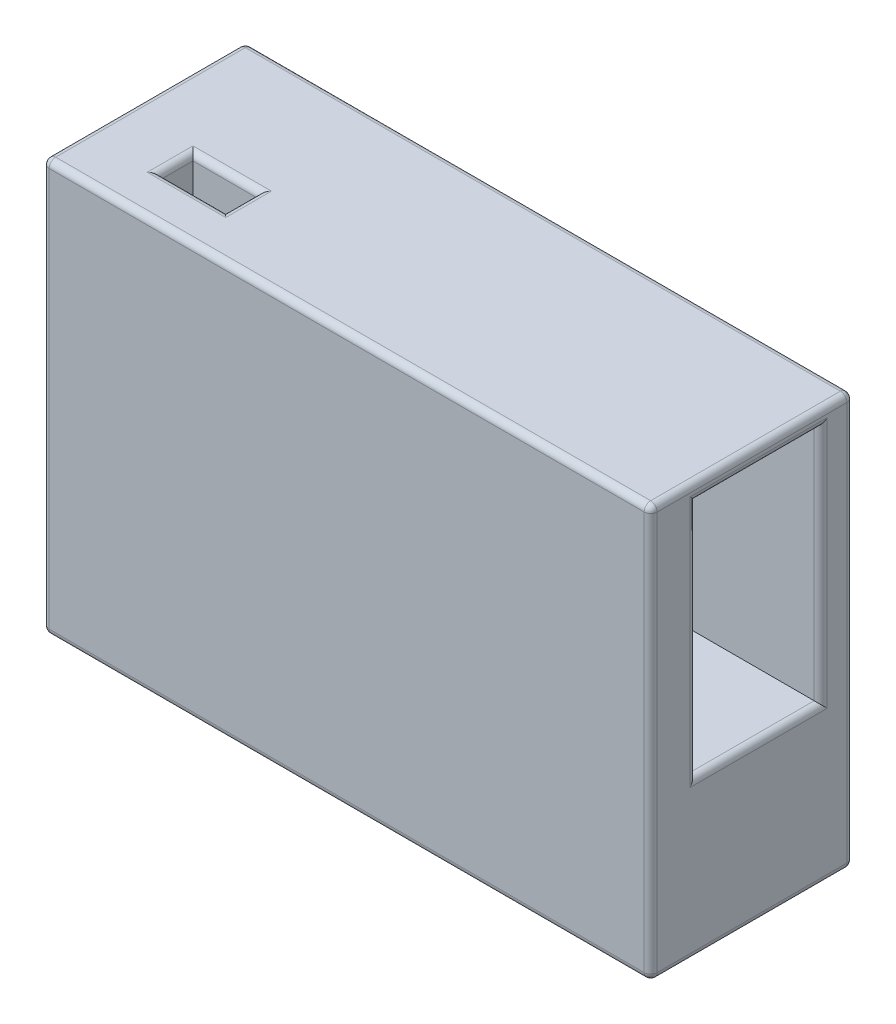
ISO-10303-21;
HEADER;
FILE_DESCRIPTION(('STEP AP214'),'2;1');
FILE_NAME('part.step','',(''),(''),'','','');
FILE_SCHEMA(('AUTOMOTIVE_DESIGN { 1 0 10303 214 1 1 1 1 }'));
ENDSEC;
DATA;
#1=APPLICATION_CONTEXT('core data for automotive mechanical design processes');
#2=APPLICATION_PROTOCOL_DEFINITION('international standard','automotive_design',2000,#1);
#3=PRODUCT_CONTEXT('',#1,'mechanical');
#4=PRODUCT('Part','Part','',(#3));
#5=PRODUCT_RELATED_PRODUCT_CATEGORY('part','',(#4));
#6=PRODUCT_DEFINITION_FORMATION('','',#4);
#7=PRODUCT_DEFINITION_CONTEXT('part definition',#1,'design');
#8=PRODUCT_DEFINITION('design','',#6,#7);
#9=PRODUCT_DEFINITION_SHAPE('','',#8);
#10=(LENGTH_UNIT() NAMED_UNIT(*) SI_UNIT(.MILLI.,.METRE.));
#11=(NAMED_UNIT(*) PLANE_ANGLE_UNIT() SI_UNIT($,.RADIAN.));
#12=(NAMED_UNIT(*) SI_UNIT($,.STERADIAN.) SOLID_ANGLE_UNIT());
#13=UNCERTAINTY_MEASURE_WITH_UNIT(LENGTH_MEASURE(1.E-05),#10,'distance_accuracy_value','');
#14=(GEOMETRIC_REPRESENTATION_CONTEXT(3) GLOBAL_UNCERTAINTY_ASSIGNED_CONTEXT((#13)) GLOBAL_UNIT_ASSIGNED_CONTEXT((#10,
#11,#12)) REPRESENTATION_CONTEXT('',''));
#15=CARTESIAN_POINT('',(0.,0.,0.));
#16=DIRECTION('',(0.,0.,1.));
#17=DIRECTION('',(1.,0.,0.));
#18=AXIS2_PLACEMENT_3D('',#15,#16,#17);
#19=CARTESIAN_POINT('',(46.5,-31.5,31.));
#20=DIRECTION('',(-1.,0.,0.));
#21=DIRECTION('',(0.,0.,1.));
#22=AXIS2_PLACEMENT_3D('',#19,#20,#21);
#23=PLANE('',#22);
#24=DIRECTION('',(0.,0.,1.));
#25=VECTOR('',#24,1.);
#26=CARTESIAN_POINT('',(46.5,30.,31.));
#27=LINE('',#26,#25);
#28=CARTESIAN_POINT('',(46.5,30.,25.));
#29=VERTEX_POINT('',#28);
#30=CARTESIAN_POINT('',(46.5,30.,4.));
#31=VERTEX_POINT('',#30);
#32=EDGE_CURVE('E307',#29,#31,#27,.F.);
#33=ORIENTED_EDGE('',*,*,#32,.T.);
#34=DIRECTION('',(0.,1.,0.));
#35=VECTOR('',#34,1.);
#36=CARTESIAN_POINT('',(46.5,-31.5,4.));
#37=LINE('',#36,#35);
#38=CARTESIAN_POINT('',(46.5,-8.5,4.));
#39=VERTEX_POINT('',#38);
#40=EDGE_CURVE('E309',#31,#39,#37,.F.);
#41=ORIENTED_EDGE('',*,*,#40,.T.);
#42=DIRECTION('',(0.,0.,-1.));
#43=VECTOR('',#42,1.);
#44=CARTESIAN_POINT('',(46.5,-8.5,31.));
#45=LINE('',#44,#43);
#46=CARTESIAN_POINT('',(46.5,-8.5,25.));
#47=VERTEX_POINT('',#46);
#48=EDGE_CURVE('E303',#39,#47,#45,.F.);
#49=ORIENTED_EDGE('',*,*,#48,.T.);
#50=DIRECTION('',(0.,-1.,0.));
#51=VECTOR('',#50,1.);
#52=CARTESIAN_POINT('',(46.5,-31.5,25.));
#53=LINE('',#52,#51);
#54=EDGE_CURVE('E305',#47,#29,#53,.F.);
#55=ORIENTED_EDGE('',*,*,#54,.T.);
#56=EDGE_LOOP('',(#33,#41,#49,#55));
#57=FACE_BOUND('',#56,.T.);
#58=DIRECTION('',(0.,1.,0.));
#59=VECTOR('',#58,1.);
#60=CARTESIAN_POINT('',(46.5,-31.5,30.));
#61=LINE('',#60,#59);
#62=CARTESIAN_POINT('',(46.5,30.5,30.));
#63=VERTEX_POINT('',#62);
#64=CARTESIAN_POINT('',(46.5,-30.5,30.));
#65=VERTEX_POINT('',#64);
#66=EDGE_CURVE('E298',#63,#65,#61,.F.);
#67=ORIENTED_EDGE('',*,*,#66,.T.);
#68=DIRECTION('',(0.,0.,-1.));
#69=VECTOR('',#68,1.);
#70=CARTESIAN_POINT('',(46.5,-30.5,31.));
#71=LINE('',#70,#69);
#72=CARTESIAN_POINT('',(46.5,-30.5,1.));
#73=VERTEX_POINT('',#72);
#74=EDGE_CURVE('E300',#65,#73,#71,.T.);
#75=ORIENTED_EDGE('',*,*,#74,.T.);
#76=DIRECTION('',(0.,1.,0.));
#77=VECTOR('',#76,1.);
#78=CARTESIAN_POINT('',(46.5,31.5,1.));
#79=LINE('',#78,#77);
#80=CARTESIAN_POINT('',(46.5,30.5,1.));
#81=VERTEX_POINT('',#80);
#82=EDGE_CURVE('E296',#73,#81,#79,.T.);
#83=ORIENTED_EDGE('',*,*,#82,.T.);
#84=DIRECTION('',(0.,0.,-1.));
#85=VECTOR('',#84,1.);
#86=CARTESIAN_POINT('',(46.5,30.5,31.));
#87=LINE('',#86,#85);
#88=EDGE_CURVE('E294',#81,#63,#87,.F.);
#89=ORIENTED_EDGE('',*,*,#88,.T.);
#90=EDGE_LOOP('',(#67,#75,#83,#89));
#91=FACE_BOUND('',#90,.T.);
#92=ADVANCED_FACE('F39',(#57,#91),#23,.F.);
#93=CARTESIAN_POINT('',(-46.5,31.5,31.));
#94=DIRECTION('',(0.,-1.,0.));
#95=DIRECTION('',(0.,0.,-1.));
#96=AXIS2_PLACEMENT_3D('',#93,#94,#95);
#97=PLANE('',#96);
#98=DIRECTION('',(-1.,0.,0.));
#99=VECTOR('',#98,1.);
#100=CARTESIAN_POINT('',(-46.5,31.5,30.));
#101=LINE('',#100,#99);
#102=CARTESIAN_POINT('',(-45.5,31.5,30.));
#103=VERTEX_POINT('',#102);
#104=CARTESIAN_POINT('',(45.5,31.5,30.));
#105=VERTEX_POINT('',#104);
#106=EDGE_CURVE('E334',#103,#105,#101,.F.);
#107=ORIENTED_EDGE('',*,*,#106,.T.);
#108=DIRECTION('',(0.,0.,-1.));
#109=VECTOR('',#108,1.);
#110=CARTESIAN_POINT('',(45.5,31.5,31.));
#111=LINE('',#110,#109);
#112=CARTESIAN_POINT('',(45.5,31.5,1.));
#113=VERTEX_POINT('',#112);
#114=EDGE_CURVE('E336',#105,#113,#111,.T.);
#115=ORIENTED_EDGE('',*,*,#114,.T.);
#116=DIRECTION('',(-1.,0.,0.));
#117=VECTOR('',#116,1.);
#118=CARTESIAN_POINT('',(-46.5,31.5,1.));
#119=LINE('',#118,#117);
#120=CARTESIAN_POINT('',(-45.5,31.5,1.));
#121=VERTEX_POINT('',#120);
#122=EDGE_CURVE('E330',#113,#121,#119,.T.);
#123=ORIENTED_EDGE('',*,*,#122,.T.);
#124=DIRECTION('',(0.,0.,-1.));
#125=VECTOR('',#124,1.);
#126=CARTESIAN_POINT('',(-45.5,31.5,31.));
#127=LINE('',#126,#125);
#128=EDGE_CURVE('E332',#121,#103,#127,.F.);
#129=ORIENTED_EDGE('',*,*,#128,.T.);
#130=EDGE_LOOP('',(#107,#115,#123,#129));
#131=FACE_BOUND('',#130,.T.);
#132=DIRECTION('',(-1.,0.,0.));
#133=VECTOR('',#132,1.);
#134=CARTESIAN_POINT('',(-46.5,31.5,18.));
#135=LINE('',#134,#133);
#136=CARTESIAN_POINT('',(-36.5,31.5,18.));
#137=VERTEX_POINT('',#136);
#138=CARTESIAN_POINT('',(-24.5,31.5,18.));
#139=VERTEX_POINT('',#138);
#140=EDGE_CURVE('E325',#137,#139,#135,.F.);
#141=ORIENTED_EDGE('',*,*,#140,.T.);
#142=DIRECTION('',(0.,0.,-1.));
#143=VECTOR('',#142,1.);
#144=CARTESIAN_POINT('',(-24.5,31.5,31.));
#145=LINE('',#144,#143);
#146=CARTESIAN_POINT('',(-24.5,31.5,25.));
#147=VERTEX_POINT('',#146);
#148=EDGE_CURVE('E327',#139,#147,#145,.F.);
#149=ORIENTED_EDGE('',*,*,#148,.T.);
#150=DIRECTION('',(1.,0.,0.));
#151=VECTOR('',#150,1.);
#152=CARTESIAN_POINT('',(-46.5,31.5,25.));
#153=LINE('',#152,#151);
#154=CARTESIAN_POINT('',(-36.5,31.5,25.));
#155=VERTEX_POINT('',#154);
#156=EDGE_CURVE('E321',#147,#155,#153,.F.);
#157=ORIENTED_EDGE('',*,*,#156,.T.);
#158=DIRECTION('',(0.,0.,1.));
#159=VECTOR('',#158,1.);
#160=CARTESIAN_POINT('',(-36.5,31.5,31.));
#161=LINE('',#160,#159);
#162=EDGE_CURVE('E323',#155,#137,#161,.F.);
#163=ORIENTED_EDGE('',*,*,#162,.T.);
#164=EDGE_LOOP('',(#141,#149,#157,#163));
#165=FACE_BOUND('',#164,.T.);
#166=ADVANCED_FACE('F434',(#131,#165),#97,.F.);
#167=CARTESIAN_POINT('',(-46.5,-31.5,31.));
#168=DIRECTION('',(1.,0.,0.));
#169=DIRECTION('',(0.,0.,-1.));
#170=AXIS2_PLACEMENT_3D('',#167,#168,#169);
#171=PLANE('',#170);
#172=DIRECTION('',(0.,0.,-1.));
#173=VECTOR('',#172,1.);
#174=CARTESIAN_POINT('',(-46.5,30.5,31.));
#175=LINE('',#174,#173);
#176=CARTESIAN_POINT('',(-46.5,30.5,30.));
#177=VERTEX_POINT('',#176);
#178=CARTESIAN_POINT('',(-46.5,30.5,1.));
#179=VERTEX_POINT('',#178);
#180=EDGE_CURVE('E250',#177,#179,#175,.T.);
#181=ORIENTED_EDGE('',*,*,#180,.T.);
#182=DIRECTION('',(0.,-1.,0.));
#183=VECTOR('',#182,1.);
#184=CARTESIAN_POINT('',(-46.5,-31.5,1.));
#185=LINE('',#184,#183);
#186=CARTESIAN_POINT('',(-46.5,-30.5,1.));
#187=VERTEX_POINT('',#186);
#188=EDGE_CURVE('E264',#179,#187,#185,.T.);
#189=ORIENTED_EDGE('',*,*,#188,.T.);
#190=DIRECTION('',(0.,0.,-1.));
#191=VECTOR('',#190,1.);
#192=CARTESIAN_POINT('',(-46.5,-30.5,31.));
#193=LINE('',#192,#191);
#194=CARTESIAN_POINT('',(-46.5,-30.5,30.));
#195=VERTEX_POINT('',#194);
#196=EDGE_CURVE('E262',#187,#195,#193,.F.);
#197=ORIENTED_EDGE('',*,*,#196,.T.);
#198=DIRECTION('',(0.,-1.,0.));
#199=VECTOR('',#198,1.);
#200=CARTESIAN_POINT('',(-46.5,-31.5,30.));
#201=LINE('',#200,#199);
#202=EDGE_CURVE('E260',#195,#177,#201,.F.);
#203=ORIENTED_EDGE('',*,*,#202,.T.);
#204=EDGE_LOOP('',(#181,#189,#197,#203));
#205=FACE_BOUND('',#204,.T.);
#206=ADVANCED_FACE('F460',(#205),#171,.F.);
#207=CARTESIAN_POINT('',(-46.5,-31.5,31.));
#208=DIRECTION('',(0.,1.,0.));
#209=DIRECTION('',(0.,0.,1.));
#210=AXIS2_PLACEMENT_3D('',#207,#208,#209);
#211=PLANE('',#210);
#212=DIRECTION('',(1.,0.,0.));
#213=VECTOR('',#212,1.);
#214=CARTESIAN_POINT('',(-46.5,-31.5,30.));
#215=LINE('',#214,#213);
#216=CARTESIAN_POINT('',(45.5,-31.5,30.));
#217=VERTEX_POINT('',#216);
#218=CARTESIAN_POINT('',(-45.5,-31.5,30.));
#219=VERTEX_POINT('',#218);
#220=EDGE_CURVE('E278',#217,#219,#215,.F.);
#221=ORIENTED_EDGE('',*,*,#220,.T.);
#222=DIRECTION('',(0.,0.,-1.));
#223=VECTOR('',#222,1.);
#224=CARTESIAN_POINT('',(-45.5,-31.5,31.));
#225=LINE('',#224,#223);
#226=CARTESIAN_POINT('',(-45.5,-31.5,1.));
#227=VERTEX_POINT('',#226);
#228=EDGE_CURVE('E282',#219,#227,#225,.T.);
#229=ORIENTED_EDGE('',*,*,#228,.T.);
#230=DIRECTION('',(1.,0.,0.));
#231=VECTOR('',#230,1.);
#232=CARTESIAN_POINT('',(46.5,-31.5,1.));
#233=LINE('',#232,#231);
#234=CARTESIAN_POINT('',(45.5,-31.5,1.));
#235=VERTEX_POINT('',#234);
#236=EDGE_CURVE('E280',#227,#235,#233,.T.);
#237=ORIENTED_EDGE('',*,*,#236,.T.);
#238=DIRECTION('',(0.,0.,-1.));
#239=VECTOR('',#238,1.);
#240=CARTESIAN_POINT('',(45.5,-31.5,31.));
#241=LINE('',#240,#239);
#242=EDGE_CURVE('E276',#235,#217,#241,.F.);
#243=ORIENTED_EDGE('',*,*,#242,.T.);
#244=EDGE_LOOP('',(#221,#229,#237,#243));
#245=FACE_BOUND('',#244,.T.);
#246=ADVANCED_FACE('F851',(#245),#211,.F.);
#247=CARTESIAN_POINT('',(0.,0.,31.));
#248=DIRECTION('',(0.,0.,-1.));
#249=DIRECTION('',(-1.,0.,0.));
#250=AXIS2_PLACEMENT_3D('',#247,#248,#249);
#251=PLANE('',#250);
#252=DIRECTION('',(0.,-1.,0.));
#253=VECTOR('',#252,1.);
#254=CARTESIAN_POINT('',(-45.5,0.,31.));
#255=LINE('',#254,#253);
#256=CARTESIAN_POINT('',(-45.5,30.5,31.));
#257=VERTEX_POINT('',#256);
#258=CARTESIAN_POINT('',(-45.5,-30.5,31.));
#259=VERTEX_POINT('',#258);
#260=EDGE_CURVE('E289',#257,#259,#255,.T.);
#261=ORIENTED_EDGE('',*,*,#260,.T.);
#262=DIRECTION('',(1.,0.,0.));
#263=VECTOR('',#262,1.);
#264=CARTESIAN_POINT('',(0.,-30.5,31.));
#265=LINE('',#264,#263);
#266=CARTESIAN_POINT('',(45.5,-30.5,31.));
#267=VERTEX_POINT('',#266);
#268=EDGE_CURVE('E291',#259,#267,#265,.T.);
#269=ORIENTED_EDGE('',*,*,#268,.T.);
#270=DIRECTION('',(0.,1.,0.));
#271=VECTOR('',#270,1.);
#272=CARTESIAN_POINT('',(45.5,0.,31.));
#273=LINE('',#272,#271);
#274=CARTESIAN_POINT('',(45.5,30.5,31.));
#275=VERTEX_POINT('',#274);
#276=EDGE_CURVE('E287',#267,#275,#273,.T.);
#277=ORIENTED_EDGE('',*,*,#276,.T.);
#278=DIRECTION('',(-1.,0.,0.));
#279=VECTOR('',#278,1.);
#280=CARTESIAN_POINT('',(0.,30.5,31.));
#281=LINE('',#280,#279);
#282=EDGE_CURVE('E285',#275,#257,#281,.T.);
#283=ORIENTED_EDGE('',*,*,#282,.T.);
#284=EDGE_LOOP('',(#261,#269,#277,#283));
#285=FACE_BOUND('',#284,.T.);
#286=ADVANCED_FACE('F842',(#285),#251,.F.);
#287=CARTESIAN_POINT('',(0.,0.,0.));
#288=DIRECTION('',(0.,0.,-1.));
#289=DIRECTION('',(-1.,0.,0.));
#290=AXIS2_PLACEMENT_3D('',#287,#288,#289);
#291=PLANE('',#290);
#292=DIRECTION('',(1.,0.,0.));
#293=VECTOR('',#292,1.);
#294=CARTESIAN_POINT('',(-46.5,-30.5,0.));
#295=LINE('',#294,#293);
#296=CARTESIAN_POINT('',(45.5,-30.5,0.));
#297=VERTEX_POINT('',#296);
#298=CARTESIAN_POINT('',(-45.5,-30.5,0.));
#299=VERTEX_POINT('',#298);
#300=EDGE_CURVE('E271',#297,#299,#295,.F.);
#301=ORIENTED_EDGE('',*,*,#300,.T.);
#302=DIRECTION('',(0.,-1.,0.));
#303=VECTOR('',#302,1.);
#304=CARTESIAN_POINT('',(-45.5,31.5,0.));
#305=LINE('',#304,#303);
#306=CARTESIAN_POINT('',(-45.5,30.5,0.));
#307=VERTEX_POINT('',#306);
#308=EDGE_CURVE('E273',#299,#307,#305,.F.);
#309=ORIENTED_EDGE('',*,*,#308,.T.);
#310=DIRECTION('',(-1.,0.,0.));
#311=VECTOR('',#310,1.);
#312=CARTESIAN_POINT('',(46.5,30.5,0.));
#313=LINE('',#312,#311);
#314=CARTESIAN_POINT('',(45.5,30.5,0.));
#315=VERTEX_POINT('',#314);
#316=EDGE_CURVE('E267',#307,#315,#313,.F.);
#317=ORIENTED_EDGE('',*,*,#316,.T.);
#318=DIRECTION('',(0.,1.,0.));
#319=VECTOR('',#318,1.);
#320=CARTESIAN_POINT('',(45.5,-31.5,0.));
#321=LINE('',#320,#319);
#322=EDGE_CURVE('E269',#315,#297,#321,.F.);
#323=ORIENTED_EDGE('',*,*,#322,.T.);
#324=EDGE_LOOP('',(#301,#309,#317,#323));
#325=FACE_BOUND('',#324,.T.);
#326=ADVANCED_FACE('F832',(#325),#291,.T.);
#327=CARTESIAN_POINT('',(15.5,29.,24.));
#328=DIRECTION('',(0.,0.,1.));
#329=DIRECTION('',(0.,-1.,0.));
#330=AXIS2_PLACEMENT_3D('',#327,#328,#329);
#331=PLANE('',#330);
#332=DIRECTION('',(1.,0.,0.));
#333=VECTOR('',#332,1.);
#334=CARTESIAN_POINT('',(15.5,29.,24.));
#335=LINE('',#334,#333);
#336=CARTESIAN_POINT('',(15.5,29.,24.));
#337=VERTEX_POINT('',#336);
#338=CARTESIAN_POINT('',(45.5,29.,24.));
#339=VERTEX_POINT('',#338);
#340=EDGE_CURVE('E247',#337,#339,#335,.T.);
#341=ORIENTED_EDGE('',*,*,#340,.T.);
#342=DIRECTION('',(0.,-1.,0.));
#343=VECTOR('',#342,1.);
#344=CARTESIAN_POINT('',(45.5,29.,24.));
#345=LINE('',#344,#343);
#346=CARTESIAN_POINT('',(45.5,-7.5,24.));
#347=VERTEX_POINT('',#346);
#348=EDGE_CURVE('E317',#339,#347,#345,.T.);
#349=ORIENTED_EDGE('',*,*,#348,.T.);
#350=DIRECTION('',(1.,0.,0.));
#351=VECTOR('',#350,1.);
#352=CARTESIAN_POINT('',(15.5,-7.5,24.));
#353=LINE('',#352,#351);
#354=CARTESIAN_POINT('',(15.5,-7.5,24.));
#355=VERTEX_POINT('',#354);
#356=EDGE_CURVE('E246',#355,#347,#353,.T.);
#357=ORIENTED_EDGE('',*,*,#356,.F.);
#358=DIRECTION('',(0.,-1.,0.));
#359=VECTOR('',#358,1.);
#360=CARTESIAN_POINT('',(15.5,29.,24.));
#361=LINE('',#360,#359);
#362=EDGE_CURVE('E231',#337,#355,#361,.T.);
#363=ORIENTED_EDGE('',*,*,#362,.F.);
#364=EDGE_LOOP('',(#341,#349,#357,#363));
#365=FACE_BOUND('',#364,.T.);
#366=ADVANCED_FACE('F823',(#365),#331,.F.);
#367=CARTESIAN_POINT('',(15.5,29.,24.));
#368=DIRECTION('',(0.,1.,0.));
#369=DIRECTION('',(0.,0.,1.));
#370=AXIS2_PLACEMENT_3D('',#367,#368,#369);
#371=PLANE('',#370);
#372=DIRECTION('',(1.,0.,0.));
#373=VECTOR('',#372,1.);
#374=CARTESIAN_POINT('',(15.5,29.,5.));
#375=LINE('',#374,#373);
#376=CARTESIAN_POINT('',(15.5,29.,5.));
#377=VERTEX_POINT('',#376);
#378=CARTESIAN_POINT('',(45.5,29.,5.));
#379=VERTEX_POINT('',#378);
#380=EDGE_CURVE('E251',#377,#379,#375,.T.);
#381=ORIENTED_EDGE('',*,*,#380,.T.);
#382=DIRECTION('',(0.,0.,1.));
#383=VECTOR('',#382,1.);
#384=CARTESIAN_POINT('',(45.5,29.,24.));
#385=LINE('',#384,#383);
#386=EDGE_CURVE('E315',#379,#339,#385,.T.);
#387=ORIENTED_EDGE('',*,*,#386,.T.);
#388=ORIENTED_EDGE('',*,*,#340,.F.);
#389=DIRECTION('',(0.,0.,1.));
#390=VECTOR('',#389,1.);
#391=CARTESIAN_POINT('',(15.5,29.,24.));
#392=LINE('',#391,#390);
#393=EDGE_CURVE('E243',#377,#337,#392,.T.);
#394=ORIENTED_EDGE('',*,*,#393,.F.);
#395=EDGE_LOOP('',(#381,#387,#388,#394));
#396=FACE_BOUND('',#395,.T.);
#397=ADVANCED_FACE('F813',(#396),#371,.F.);
#398=CARTESIAN_POINT('',(15.5,29.,5.));
#399=DIRECTION('',(0.,0.,-1.));
#400=DIRECTION('',(0.,1.,0.));
#401=AXIS2_PLACEMENT_3D('',#398,#399,#400);
#402=PLANE('',#401);
#403=DIRECTION('',(1.,0.,0.));
#404=VECTOR('',#403,1.);
#405=CARTESIAN_POINT('',(15.5,-7.5,5.));
#406=LINE('',#405,#404);
#407=CARTESIAN_POINT('',(15.5,-7.5,5.));
#408=VERTEX_POINT('',#407);
#409=CARTESIAN_POINT('',(45.5,-7.5,5.));
#410=VERTEX_POINT('',#409);
#411=EDGE_CURVE('E254',#408,#410,#406,.T.);
#412=ORIENTED_EDGE('',*,*,#411,.T.);
#413=DIRECTION('',(0.,1.,0.));
#414=VECTOR('',#413,1.);
#415=CARTESIAN_POINT('',(45.5,29.,5.));
#416=LINE('',#415,#414);
#417=EDGE_CURVE('E312',#410,#379,#416,.T.);
#418=ORIENTED_EDGE('',*,*,#417,.T.);
#419=ORIENTED_EDGE('',*,*,#380,.F.);
#420=DIRECTION('',(0.,1.,0.));
#421=VECTOR('',#420,1.);
#422=CARTESIAN_POINT('',(15.5,29.,5.));
#423=LINE('',#422,#421);
#424=EDGE_CURVE('E240',#408,#377,#423,.T.);
#425=ORIENTED_EDGE('',*,*,#424,.F.);
#426=EDGE_LOOP('',(#412,#418,#419,#425));
#427=FACE_BOUND('',#426,.T.);
#428=ADVANCED_FACE('F803',(#427),#402,.F.);
#429=CARTESIAN_POINT('',(15.5,-7.5,24.));
#430=DIRECTION('',(0.,-1.,0.));
#431=DIRECTION('',(0.,0.,-1.));
#432=AXIS2_PLACEMENT_3D('',#429,#430,#431);
#433=PLANE('',#432);
#434=ORIENTED_EDGE('',*,*,#356,.T.);
#435=DIRECTION('',(0.,0.,-1.));
#436=VECTOR('',#435,1.);
#437=CARTESIAN_POINT('',(45.5,-7.5,24.));
#438=LINE('',#437,#436);
#439=EDGE_CURVE('E319',#347,#410,#438,.T.);
#440=ORIENTED_EDGE('',*,*,#439,.T.);
#441=ORIENTED_EDGE('',*,*,#411,.F.);
#442=DIRECTION('',(0.,0.,-1.));
#443=VECTOR('',#442,1.);
#444=CARTESIAN_POINT('',(15.5,-7.5,24.));
#445=LINE('',#444,#443);
#446=EDGE_CURVE('E237',#355,#408,#445,.T.);
#447=ORIENTED_EDGE('',*,*,#446,.F.);
#448=EDGE_LOOP('',(#434,#440,#441,#447));
#449=FACE_BOUND('',#448,.T.);
#450=ADVANCED_FACE('F794',(#449),#433,.F.);
#451=CARTESIAN_POINT('',(15.5,0.,0.));
#452=DIRECTION('',(1.,0.,0.));
#453=DIRECTION('',(0.,0.,-1.));
#454=AXIS2_PLACEMENT_3D('',#451,#452,#453);
#455=PLANE('',#454);
#456=ORIENTED_EDGE('',*,*,#362,.T.);
#457=ORIENTED_EDGE('',*,*,#446,.T.);
#458=ORIENTED_EDGE('',*,*,#424,.T.);
#459=ORIENTED_EDGE('',*,*,#393,.T.);
#460=EDGE_LOOP('',(#456,#457,#458,#459));
#461=FACE_BOUND('',#460,.T.);
#462=ADVANCED_FACE('F451',(#461),#455,.T.);
#463=CARTESIAN_POINT('',(-35.5,0.5,19.));
#464=DIRECTION('',(-1.,0.,0.));
#465=DIRECTION('',(0.,0.,1.));
#466=AXIS2_PLACEMENT_3D('',#463,#464,#465);
#467=PLANE('',#466);
#468=DIRECTION('',(0.,1.,0.));
#469=VECTOR('',#468,1.);
#470=CARTESIAN_POINT('',(-35.5,0.5,19.));
#471=LINE('',#470,#469);
#472=CARTESIAN_POINT('',(-35.5,0.5,19.));
#473=VERTEX_POINT('',#472);
#474=CARTESIAN_POINT('',(-35.5,30.5,19.));
#475=VERTEX_POINT('',#474);
#476=EDGE_CURVE('E229',#473,#475,#471,.T.);
#477=ORIENTED_EDGE('',*,*,#476,.T.);
#478=DIRECTION('',(0.,0.,1.));
#479=VECTOR('',#478,1.);
#480=CARTESIAN_POINT('',(-35.5,30.5,19.));
#481=LINE('',#480,#479);
#482=CARTESIAN_POINT('',(-35.5,30.5,24.));
#483=VERTEX_POINT('',#482);
#484=EDGE_CURVE('E48',#475,#483,#481,.T.);
#485=ORIENTED_EDGE('',*,*,#484,.T.);
#486=DIRECTION('',(0.,1.,0.));
#487=VECTOR('',#486,1.);
#488=CARTESIAN_POINT('',(-35.5,0.5,24.));
#489=LINE('',#488,#487);
#490=CARTESIAN_POINT('',(-35.5,0.5,24.));
#491=VERTEX_POINT('',#490);
#492=EDGE_CURVE('E199',#491,#483,#489,.T.);
#493=ORIENTED_EDGE('',*,*,#492,.F.);
#494=DIRECTION('',(0.,0.,1.));
#495=VECTOR('',#494,1.);
#496=CARTESIAN_POINT('',(-35.5,0.5,19.));
#497=LINE('',#496,#495);
#498=EDGE_CURVE('E203',#473,#491,#497,.T.);
#499=ORIENTED_EDGE('',*,*,#498,.F.);
#500=EDGE_LOOP('',(#477,#485,#493,#499));
#501=FACE_BOUND('',#500,.T.);
#502=ADVANCED_FACE('F201',(#501),#467,.F.);
#503=CARTESIAN_POINT('',(-35.5,0.5,19.));
#504=DIRECTION('',(0.,0.,-1.));
#505=DIRECTION('',(-1.,0.,0.));
#506=AXIS2_PLACEMENT_3D('',#503,#504,#505);
#507=PLANE('',#506);
#508=DIRECTION('',(0.,1.,0.));
#509=VECTOR('',#508,1.);
#510=CARTESIAN_POINT('',(-25.5,0.5,19.));
#511=LINE('',#510,#509);
#512=CARTESIAN_POINT('',(-25.5,0.5,19.));
#513=VERTEX_POINT('',#512);
#514=CARTESIAN_POINT('',(-25.5,30.5,19.));
#515=VERTEX_POINT('',#514);
#516=EDGE_CURVE('E232',#513,#515,#511,.T.);
#517=ORIENTED_EDGE('',*,*,#516,.T.);
#518=DIRECTION('',(-1.,0.,0.));
#519=VECTOR('',#518,1.);
#520=CARTESIAN_POINT('',(-35.5,30.5,19.));
#521=LINE('',#520,#519);
#522=EDGE_CURVE('E63',#515,#475,#521,.T.);
#523=ORIENTED_EDGE('',*,*,#522,.T.);
#524=ORIENTED_EDGE('',*,*,#476,.F.);
#525=DIRECTION('',(-1.,0.,0.));
#526=VECTOR('',#525,1.);
#527=CARTESIAN_POINT('',(-35.5,0.5,19.));
#528=LINE('',#527,#526);
#529=EDGE_CURVE('E208',#513,#473,#528,.T.);
#530=ORIENTED_EDGE('',*,*,#529,.F.);
#531=EDGE_LOOP('',(#517,#523,#524,#530));
#532=FACE_BOUND('',#531,.T.);
#533=ADVANCED_FACE('F443',(#532),#507,.F.);
#534=CARTESIAN_POINT('',(-25.5,0.5,19.));
#535=DIRECTION('',(1.,0.,0.));
#536=DIRECTION('',(0.,0.,-1.));
#537=AXIS2_PLACEMENT_3D('',#534,#535,#536);
#538=PLANE('',#537);
#539=DIRECTION('',(0.,1.,0.));
#540=VECTOR('',#539,1.);
#541=CARTESIAN_POINT('',(-25.5,0.5,24.));
#542=LINE('',#541,#540);
#543=CARTESIAN_POINT('',(-25.5,0.5,24.));
#544=VERTEX_POINT('',#543);
#545=CARTESIAN_POINT('',(-25.5,30.5,24.));
#546=VERTEX_POINT('',#545);
#547=EDGE_CURVE('E207',#544,#546,#542,.T.);
#548=ORIENTED_EDGE('',*,*,#547,.T.);
#549=DIRECTION('',(0.,0.,-1.));
#550=VECTOR('',#549,1.);
#551=CARTESIAN_POINT('',(-25.5,30.5,19.));
#552=LINE('',#551,#550);
#553=EDGE_CURVE('E339',#546,#515,#552,.T.);
#554=ORIENTED_EDGE('',*,*,#553,.T.);
#555=ORIENTED_EDGE('',*,*,#516,.F.);
#556=DIRECTION('',(0.,0.,-1.));
#557=VECTOR('',#556,1.);
#558=CARTESIAN_POINT('',(-25.5,0.5,19.));
#559=LINE('',#558,#557);
#560=EDGE_CURVE('E217',#544,#513,#559,.T.);
#561=ORIENTED_EDGE('',*,*,#560,.F.);
#562=EDGE_LOOP('',(#548,#554,#555,#561));
#563=FACE_BOUND('',#562,.T.);
#564=ADVANCED_FACE('F442',(#563),#538,.F.);
#565=CARTESIAN_POINT('',(-35.5,0.5,24.));
#566=DIRECTION('',(0.,0.,1.));
#567=DIRECTION('',(1.,0.,0.));
#568=AXIS2_PLACEMENT_3D('',#565,#566,#567);
#569=PLANE('',#568);
#570=ORIENTED_EDGE('',*,*,#492,.T.);
#571=DIRECTION('',(1.,0.,0.));
#572=VECTOR('',#571,1.);
#573=CARTESIAN_POINT('',(-35.5,30.5,24.));
#574=LINE('',#573,#572);
#575=EDGE_CURVE('E11',#483,#546,#574,.T.);
#576=ORIENTED_EDGE('',*,*,#575,.T.);
#577=ORIENTED_EDGE('',*,*,#547,.F.);
#578=DIRECTION('',(1.,0.,0.));
#579=VECTOR('',#578,1.);
#580=CARTESIAN_POINT('',(-35.5,0.5,24.));
#581=LINE('',#580,#579);
#582=EDGE_CURVE('E211',#491,#544,#581,.T.);
#583=ORIENTED_EDGE('',*,*,#582,.F.);
#584=EDGE_LOOP('',(#570,#576,#577,#583));
#585=FACE_BOUND('',#584,.T.);
#586=ADVANCED_FACE('F212',(#585),#569,.F.);
#587=CARTESIAN_POINT('',(0.,0.5,0.));
#588=DIRECTION('',(0.,1.,0.));
#589=DIRECTION('',(0.,0.,1.));
#590=AXIS2_PLACEMENT_3D('',#587,#588,#589);
#591=PLANE('',#590);
#592=ORIENTED_EDGE('',*,*,#498,.T.);
#593=ORIENTED_EDGE('',*,*,#582,.T.);
#594=ORIENTED_EDGE('',*,*,#560,.T.);
#595=ORIENTED_EDGE('',*,*,#529,.T.);
#596=EDGE_LOOP('',(#592,#593,#594,#595));
#597=FACE_BOUND('',#596,.T.);
#598=ADVANCED_FACE('F219',(#597),#591,.T.);
#599=CARTESIAN_POINT('',(45.5,0.,30.));
#600=DIRECTION('',(0.,1.,0.));
#601=DIRECTION('',(0.,0.,1.));
#602=AXIS2_PLACEMENT_3D('',#599,#600,#601);
#603=CYLINDRICAL_SURFACE('',#602,1.);
#604=CARTESIAN_POINT('',(45.5,30.5,30.));
#605=DIRECTION('',(0.,1.,0.));
#606=DIRECTION('',(0.,0.,1.));
#607=AXIS2_PLACEMENT_3D('',#604,#605,#606);
#608=CIRCLE('',#607,1.);
#609=EDGE_CURVE('E221',#275,#63,#608,.T.);
#610=ORIENTED_EDGE('',*,*,#609,.F.);
#611=ORIENTED_EDGE('',*,*,#276,.F.);
#612=CARTESIAN_POINT('',(45.5,-30.5,30.));
#613=DIRECTION('',(0.,-1.,0.));
#614=DIRECTION('',(0.,0.,-1.));
#615=AXIS2_PLACEMENT_3D('',#612,#613,#614);
#616=CIRCLE('',#615,1.);
#617=EDGE_CURVE('E224',#65,#267,#616,.T.);
#618=ORIENTED_EDGE('',*,*,#617,.F.);
#619=ORIENTED_EDGE('',*,*,#66,.F.);
#620=EDGE_LOOP('',(#610,#611,#618,#619));
#621=FACE_BOUND('',#620,.T.);
#622=ADVANCED_FACE('F542',(#621),#603,.T.);
#623=CARTESIAN_POINT('',(45.5,30.5,30.));
#624=DIRECTION('',(0.,0.,1.));
#625=DIRECTION('',(1.,0.,0.));
#626=AXIS2_PLACEMENT_3D('',#623,#624,#625);
#627=SPHERICAL_SURFACE('',#626,1.);
#628=CARTESIAN_POINT('',(45.5,30.5,30.));
#629=DIRECTION('',(1.,0.,0.));
#630=DIRECTION('',(0.,0.,-1.));
#631=AXIS2_PLACEMENT_3D('',#628,#629,#630);
#632=CIRCLE('',#631,1.);
#633=EDGE_CURVE('E400',#275,#105,#632,.F.);
#634=ORIENTED_EDGE('',*,*,#633,.F.);
#635=ORIENTED_EDGE('',*,*,#609,.T.);
#636=CARTESIAN_POINT('',(45.5,30.5,30.));
#637=DIRECTION('',(0.,0.,1.));
#638=DIRECTION('',(1.,0.,0.));
#639=AXIS2_PLACEMENT_3D('',#636,#637,#638);
#640=CIRCLE('',#639,1.);
#641=EDGE_CURVE('E403',#105,#63,#640,.F.);
#642=ORIENTED_EDGE('',*,*,#641,.F.);
#643=EDGE_LOOP('',(#634,#635,#642));
#644=FACE_BOUND('',#643,.T.);
#645=ADVANCED_FACE('F538',(#644),#627,.T.);
#646=CARTESIAN_POINT('',(45.5,-30.5,30.));
#647=DIRECTION('',(0.,0.,1.));
#648=DIRECTION('',(1.,0.,0.));
#649=AXIS2_PLACEMENT_3D('',#646,#647,#648);
#650=SPHERICAL_SURFACE('',#649,1.);
#651=CARTESIAN_POINT('',(45.5,-30.5,30.));
#652=DIRECTION('',(0.,0.,1.));
#653=DIRECTION('',(1.,0.,0.));
#654=AXIS2_PLACEMENT_3D('',#651,#652,#653);
#655=CIRCLE('',#654,1.);
#656=EDGE_CURVE('E395',#65,#217,#655,.F.);
#657=ORIENTED_EDGE('',*,*,#656,.F.);
#658=ORIENTED_EDGE('',*,*,#617,.T.);
#659=CARTESIAN_POINT('',(45.5,-30.5,30.));
#660=DIRECTION('',(1.,0.,0.));
#661=DIRECTION('',(0.,0.,-1.));
#662=AXIS2_PLACEMENT_3D('',#659,#660,#661);
#663=CIRCLE('',#662,1.);
#664=EDGE_CURVE('E398',#217,#267,#663,.F.);
#665=ORIENTED_EDGE('',*,*,#664,.F.);
#666=EDGE_LOOP('',(#657,#658,#665));
#667=FACE_BOUND('',#666,.T.);
#668=ADVANCED_FACE('F534',(#667),#650,.T.);
#669=CARTESIAN_POINT('',(45.5,30.5,31.));
#670=DIRECTION('',(0.,0.,-1.));
#671=DIRECTION('',(-1.,0.,0.));
#672=AXIS2_PLACEMENT_3D('',#669,#670,#671);
#673=CYLINDRICAL_SURFACE('',#672,1.);
#674=ORIENTED_EDGE('',*,*,#641,.T.);
#675=ORIENTED_EDGE('',*,*,#88,.F.);
#676=CARTESIAN_POINT('',(45.5,30.5,1.));
#677=DIRECTION('',(0.,0.,-1.));
#678=DIRECTION('',(-1.,0.,0.));
#679=AXIS2_PLACEMENT_3D('',#676,#677,#678);
#680=CIRCLE('',#679,1.);
#681=EDGE_CURVE('E389',#113,#81,#680,.T.);
#682=ORIENTED_EDGE('',*,*,#681,.F.);
#683=ORIENTED_EDGE('',*,*,#114,.F.);
#684=EDGE_LOOP('',(#674,#675,#682,#683));
#685=FACE_BOUND('',#684,.T.);
#686=ADVANCED_FACE('F530',(#685),#673,.T.);
#687=CARTESIAN_POINT('',(0.,30.5,30.));
#688=DIRECTION('',(-1.,0.,0.));
#689=DIRECTION('',(0.,0.,1.));
#690=AXIS2_PLACEMENT_3D('',#687,#688,#689);
#691=CYLINDRICAL_SURFACE('',#690,1.);
#692=ORIENTED_EDGE('',*,*,#633,.T.);
#693=ORIENTED_EDGE('',*,*,#106,.F.);
#694=CARTESIAN_POINT('',(-45.5,30.5,30.));
#695=DIRECTION('',(-1.,0.,0.));
#696=DIRECTION('',(0.,0.,1.));
#697=AXIS2_PLACEMENT_3D('',#694,#695,#696);
#698=CIRCLE('',#697,1.);
#699=EDGE_CURVE('E386',#257,#103,#698,.T.);
#700=ORIENTED_EDGE('',*,*,#699,.F.);
#701=ORIENTED_EDGE('',*,*,#282,.F.);
#702=EDGE_LOOP('',(#692,#693,#700,#701));
#703=FACE_BOUND('',#702,.T.);
#704=ADVANCED_FACE('F526',(#703),#691,.T.);
#705=CARTESIAN_POINT('',(-45.5,0.,30.));
#706=DIRECTION('',(0.,-1.,0.));
#707=DIRECTION('',(0.,0.,-1.));
#708=AXIS2_PLACEMENT_3D('',#705,#706,#707);
#709=CYLINDRICAL_SURFACE('',#708,1.);
#710=CARTESIAN_POINT('',(-45.5,-30.5,30.));
#711=DIRECTION('',(0.,-1.,0.));
#712=DIRECTION('',(0.,0.,-1.));
#713=AXIS2_PLACEMENT_3D('',#710,#711,#712);
#714=CIRCLE('',#713,1.);
#715=EDGE_CURVE('E380',#259,#195,#714,.T.);
#716=ORIENTED_EDGE('',*,*,#715,.F.);
#717=ORIENTED_EDGE('',*,*,#260,.F.);
#718=CARTESIAN_POINT('',(-45.5,30.5,30.));
#719=DIRECTION('',(0.,1.,0.));
#720=DIRECTION('',(0.,0.,1.));
#721=AXIS2_PLACEMENT_3D('',#718,#719,#720);
#722=CIRCLE('',#721,1.);
#723=EDGE_CURVE('E383',#177,#257,#722,.T.);
#724=ORIENTED_EDGE('',*,*,#723,.F.);
#725=ORIENTED_EDGE('',*,*,#202,.F.);
#726=EDGE_LOOP('',(#716,#717,#724,#725));
#727=FACE_BOUND('',#726,.T.);
#728=ADVANCED_FACE('F522',(#727),#709,.T.);
#729=CARTESIAN_POINT('',(0.,-30.5,30.));
#730=DIRECTION('',(1.,0.,0.));
#731=DIRECTION('',(0.,0.,-1.));
#732=AXIS2_PLACEMENT_3D('',#729,#730,#731);
#733=CYLINDRICAL_SURFACE('',#732,1.);
#734=ORIENTED_EDGE('',*,*,#664,.T.);
#735=ORIENTED_EDGE('',*,*,#268,.F.);
#736=CARTESIAN_POINT('',(-45.5,-30.5,30.));
#737=DIRECTION('',(-1.,0.,0.));
#738=DIRECTION('',(0.,0.,1.));
#739=AXIS2_PLACEMENT_3D('',#736,#737,#738);
#740=CIRCLE('',#739,1.);
#741=EDGE_CURVE('E377',#219,#259,#740,.T.);
#742=ORIENTED_EDGE('',*,*,#741,.F.);
#743=ORIENTED_EDGE('',*,*,#220,.F.);
#744=EDGE_LOOP('',(#734,#735,#742,#743));
#745=FACE_BOUND('',#744,.T.);
#746=ADVANCED_FACE('F518',(#745),#733,.T.);
#747=CARTESIAN_POINT('',(45.5,-30.5,31.));
#748=DIRECTION('',(0.,0.,-1.));
#749=DIRECTION('',(-1.,0.,0.));
#750=AXIS2_PLACEMENT_3D('',#747,#748,#749);
#751=CYLINDRICAL_SURFACE('',#750,1.);
#752=ORIENTED_EDGE('',*,*,#656,.T.);
#753=ORIENTED_EDGE('',*,*,#242,.F.);
#754=CARTESIAN_POINT('',(45.5,-30.5,1.));
#755=DIRECTION('',(0.,0.,-1.));
#756=DIRECTION('',(-1.,0.,0.));
#757=AXIS2_PLACEMENT_3D('',#754,#755,#756);
#758=CIRCLE('',#757,1.);
#759=EDGE_CURVE('E374',#73,#235,#758,.T.);
#760=ORIENTED_EDGE('',*,*,#759,.F.);
#761=ORIENTED_EDGE('',*,*,#74,.F.);
#762=EDGE_LOOP('',(#752,#753,#760,#761));
#763=FACE_BOUND('',#762,.T.);
#764=ADVANCED_FACE('F514',(#763),#751,.T.);
#765=CARTESIAN_POINT('',(45.5,-31.5,1.));
#766=DIRECTION('',(0.,-1.,0.));
#767=DIRECTION('',(0.,0.,-1.));
#768=AXIS2_PLACEMENT_3D('',#765,#766,#767);
#769=CYLINDRICAL_SURFACE('',#768,1.);
#770=CARTESIAN_POINT('',(45.5,30.5,1.));
#771=DIRECTION('',(0.,1.,0.));
#772=DIRECTION('',(0.,0.,1.));
#773=AXIS2_PLACEMENT_3D('',#770,#771,#772);
#774=CIRCLE('',#773,1.);
#775=EDGE_CURVE('E392',#81,#315,#774,.T.);
#776=ORIENTED_EDGE('',*,*,#775,.F.);
#777=ORIENTED_EDGE('',*,*,#82,.F.);
#778=CARTESIAN_POINT('',(45.5,-30.5,1.));
#779=DIRECTION('',(0.,-1.,0.));
#780=DIRECTION('',(0.,0.,-1.));
#781=AXIS2_PLACEMENT_3D('',#778,#779,#780);
#782=CIRCLE('',#781,1.);
#783=EDGE_CURVE('E372',#297,#73,#782,.T.);
#784=ORIENTED_EDGE('',*,*,#783,.F.);
#785=ORIENTED_EDGE('',*,*,#322,.F.);
#786=EDGE_LOOP('',(#776,#777,#784,#785));
#787=FACE_BOUND('',#786,.T.);
#788=ADVANCED_FACE('F510',(#787),#769,.T.);
#789=CARTESIAN_POINT('',(45.5,30.5,1.));
#790=DIRECTION('',(0.,0.,1.));
#791=DIRECTION('',(1.,0.,0.));
#792=AXIS2_PLACEMENT_3D('',#789,#790,#791);
#793=SPHERICAL_SURFACE('',#792,1.);
#794=ORIENTED_EDGE('',*,*,#681,.T.);
#795=ORIENTED_EDGE('',*,*,#775,.T.);
#796=CARTESIAN_POINT('',(45.5,30.5,1.));
#797=DIRECTION('',(1.,0.,0.));
#798=DIRECTION('',(0.,0.,-1.));
#799=AXIS2_PLACEMENT_3D('',#796,#797,#798);
#800=CIRCLE('',#799,1.);
#801=EDGE_CURVE('E369',#113,#315,#800,.F.);
#802=ORIENTED_EDGE('',*,*,#801,.F.);
#803=EDGE_LOOP('',(#794,#795,#802));
#804=FACE_BOUND('',#803,.T.);
#805=ADVANCED_FACE('F506',(#804),#793,.T.);
#806=CARTESIAN_POINT('',(-45.5,30.5,30.));
#807=DIRECTION('',(0.,0.,1.));
#808=DIRECTION('',(1.,0.,0.));
#809=AXIS2_PLACEMENT_3D('',#806,#807,#808);
#810=SPHERICAL_SURFACE('',#809,1.);
#811=ORIENTED_EDGE('',*,*,#723,.T.);
#812=ORIENTED_EDGE('',*,*,#699,.T.);
#813=CARTESIAN_POINT('',(-45.5,30.5,30.));
#814=DIRECTION('',(0.,0.,1.));
#815=DIRECTION('',(1.,0.,0.));
#816=AXIS2_PLACEMENT_3D('',#813,#814,#815);
#817=CIRCLE('',#816,1.);
#818=EDGE_CURVE('E366',#177,#103,#817,.F.);
#819=ORIENTED_EDGE('',*,*,#818,.F.);
#820=EDGE_LOOP('',(#811,#812,#819));
#821=FACE_BOUND('',#820,.T.);
#822=ADVANCED_FACE('F502',(#821),#810,.T.);
#823=CARTESIAN_POINT('',(-45.5,-30.5,30.));
#824=DIRECTION('',(0.,0.,1.));
#825=DIRECTION('',(1.,0.,0.));
#826=AXIS2_PLACEMENT_3D('',#823,#824,#825);
#827=SPHERICAL_SURFACE('',#826,1.);
#828=ORIENTED_EDGE('',*,*,#741,.T.);
#829=ORIENTED_EDGE('',*,*,#715,.T.);
#830=CARTESIAN_POINT('',(-45.5,-30.5,30.));
#831=DIRECTION('',(0.,0.,1.));
#832=DIRECTION('',(1.,0.,0.));
#833=AXIS2_PLACEMENT_3D('',#830,#831,#832);
#834=CIRCLE('',#833,1.);
#835=EDGE_CURVE('E363',#219,#195,#834,.F.);
#836=ORIENTED_EDGE('',*,*,#835,.F.);
#837=EDGE_LOOP('',(#828,#829,#836));
#838=FACE_BOUND('',#837,.T.);
#839=ADVANCED_FACE('F498',(#838),#827,.T.);
#840=CARTESIAN_POINT('',(45.5,-30.5,1.));
#841=DIRECTION('',(0.,0.,1.));
#842=DIRECTION('',(1.,0.,0.));
#843=AXIS2_PLACEMENT_3D('',#840,#841,#842);
#844=SPHERICAL_SURFACE('',#843,1.);
#845=ORIENTED_EDGE('',*,*,#783,.T.);
#846=ORIENTED_EDGE('',*,*,#759,.T.);
#847=CARTESIAN_POINT('',(45.5,-30.5,1.));
#848=DIRECTION('',(1.,0.,0.));
#849=DIRECTION('',(0.,0.,-1.));
#850=AXIS2_PLACEMENT_3D('',#847,#848,#849);
#851=CIRCLE('',#850,1.);
#852=EDGE_CURVE('E360',#297,#235,#851,.F.);
#853=ORIENTED_EDGE('',*,*,#852,.F.);
#854=EDGE_LOOP('',(#845,#846,#853));
#855=FACE_BOUND('',#854,.T.);
#856=ADVANCED_FACE('F494',(#855),#844,.T.);
#857=CARTESIAN_POINT('',(-46.5,30.5,1.));
#858=DIRECTION('',(1.,0.,0.));
#859=DIRECTION('',(0.,0.,-1.));
#860=AXIS2_PLACEMENT_3D('',#857,#858,#859);
#861=CYLINDRICAL_SURFACE('',#860,1.);
#862=ORIENTED_EDGE('',*,*,#801,.T.);
#863=ORIENTED_EDGE('',*,*,#316,.F.);
#864=CARTESIAN_POINT('',(-45.5,30.5,1.));
#865=DIRECTION('',(-1.,0.,0.));
#866=DIRECTION('',(0.,0.,1.));
#867=AXIS2_PLACEMENT_3D('',#864,#865,#866);
#868=CIRCLE('',#867,1.);
#869=EDGE_CURVE('E357',#121,#307,#868,.T.);
#870=ORIENTED_EDGE('',*,*,#869,.F.);
#871=ORIENTED_EDGE('',*,*,#122,.F.);
#872=EDGE_LOOP('',(#862,#863,#870,#871));
#873=FACE_BOUND('',#872,.T.);
#874=ADVANCED_FACE('F490',(#873),#861,.T.);
#875=CARTESIAN_POINT('',(-45.5,30.5,31.));
#876=DIRECTION('',(0.,0.,-1.));
#877=DIRECTION('',(-1.,0.,0.));
#878=AXIS2_PLACEMENT_3D('',#875,#876,#877);
#879=CYLINDRICAL_SURFACE('',#878,1.);
#880=ORIENTED_EDGE('',*,*,#818,.T.);
#881=ORIENTED_EDGE('',*,*,#128,.F.);
#882=CARTESIAN_POINT('',(-45.5,30.5,1.));
#883=DIRECTION('',(0.,0.,-1.));
#884=DIRECTION('',(-1.,0.,0.));
#885=AXIS2_PLACEMENT_3D('',#882,#883,#884);
#886=CIRCLE('',#885,1.);
#887=EDGE_CURVE('E354',#179,#121,#886,.T.);
#888=ORIENTED_EDGE('',*,*,#887,.F.);
#889=ORIENTED_EDGE('',*,*,#180,.F.);
#890=EDGE_LOOP('',(#880,#881,#888,#889));
#891=FACE_BOUND('',#890,.T.);
#892=ADVANCED_FACE('F486',(#891),#879,.T.);
#893=CARTESIAN_POINT('',(-45.5,-30.5,31.));
#894=DIRECTION('',(0.,0.,-1.));
#895=DIRECTION('',(-1.,0.,0.));
#896=AXIS2_PLACEMENT_3D('',#893,#894,#895);
#897=CYLINDRICAL_SURFACE('',#896,1.);
#898=ORIENTED_EDGE('',*,*,#835,.T.);
#899=ORIENTED_EDGE('',*,*,#196,.F.);
#900=CARTESIAN_POINT('',(-45.5,-30.5,1.));
#901=DIRECTION('',(0.,0.,-1.));
#902=DIRECTION('',(-1.,0.,0.));
#903=AXIS2_PLACEMENT_3D('',#900,#901,#902);
#904=CIRCLE('',#903,1.);
#905=EDGE_CURVE('E351',#227,#187,#904,.T.);
#906=ORIENTED_EDGE('',*,*,#905,.F.);
#907=ORIENTED_EDGE('',*,*,#228,.F.);
#908=EDGE_LOOP('',(#898,#899,#906,#907));
#909=FACE_BOUND('',#908,.T.);
#910=ADVANCED_FACE('F482',(#909),#897,.T.);
#911=CARTESIAN_POINT('',(-46.5,-30.5,1.));
#912=DIRECTION('',(-1.,0.,0.));
#913=DIRECTION('',(0.,0.,1.));
#914=AXIS2_PLACEMENT_3D('',#911,#912,#913);
#915=CYLINDRICAL_SURFACE('',#914,1.);
#916=ORIENTED_EDGE('',*,*,#852,.T.);
#917=ORIENTED_EDGE('',*,*,#236,.F.);
#918=CARTESIAN_POINT('',(-45.5,-30.5,1.));
#919=DIRECTION('',(-1.,0.,0.));
#920=DIRECTION('',(0.,0.,1.));
#921=AXIS2_PLACEMENT_3D('',#918,#919,#920);
#922=CIRCLE('',#921,1.);
#923=EDGE_CURVE('E349',#299,#227,#922,.T.);
#924=ORIENTED_EDGE('',*,*,#923,.F.);
#925=ORIENTED_EDGE('',*,*,#300,.F.);
#926=EDGE_LOOP('',(#916,#917,#924,#925));
#927=FACE_BOUND('',#926,.T.);
#928=ADVANCED_FACE('F478',(#927),#915,.T.);
#929=CARTESIAN_POINT('',(-45.5,30.5,1.));
#930=DIRECTION('',(0.,0.,1.));
#931=DIRECTION('',(1.,0.,0.));
#932=AXIS2_PLACEMENT_3D('',#929,#930,#931);
#933=SPHERICAL_SURFACE('',#932,1.);
#934=ORIENTED_EDGE('',*,*,#887,.T.);
#935=ORIENTED_EDGE('',*,*,#869,.T.);
#936=CARTESIAN_POINT('',(-45.5,30.5,1.));
#937=DIRECTION('',(0.,1.,0.));
#938=DIRECTION('',(0.,0.,1.));
#939=AXIS2_PLACEMENT_3D('',#936,#937,#938);
#940=CIRCLE('',#939,1.);
#941=EDGE_CURVE('E346',#179,#307,#940,.F.);
#942=ORIENTED_EDGE('',*,*,#941,.F.);
#943=EDGE_LOOP('',(#934,#935,#942));
#944=FACE_BOUND('',#943,.T.);
#945=ADVANCED_FACE('F474',(#944),#933,.T.);
#946=CARTESIAN_POINT('',(-45.5,-30.5,1.));
#947=DIRECTION('',(0.,0.,1.));
#948=DIRECTION('',(1.,0.,0.));
#949=AXIS2_PLACEMENT_3D('',#946,#947,#948);
#950=SPHERICAL_SURFACE('',#949,1.);
#951=ORIENTED_EDGE('',*,*,#923,.T.);
#952=ORIENTED_EDGE('',*,*,#905,.T.);
#953=CARTESIAN_POINT('',(-45.5,-30.5,1.));
#954=DIRECTION('',(0.,-1.,0.));
#955=DIRECTION('',(0.,0.,-1.));
#956=AXIS2_PLACEMENT_3D('',#953,#954,#955);
#957=CIRCLE('',#956,1.);
#958=EDGE_CURVE('E344',#299,#187,#957,.F.);
#959=ORIENTED_EDGE('',*,*,#958,.F.);
#960=EDGE_LOOP('',(#951,#952,#959));
#961=FACE_BOUND('',#960,.T.);
#962=ADVANCED_FACE('F470',(#961),#950,.T.);
#963=CARTESIAN_POINT('',(-45.5,-31.5,1.));
#964=DIRECTION('',(0.,1.,0.));
#965=DIRECTION('',(0.,0.,1.));
#966=AXIS2_PLACEMENT_3D('',#963,#964,#965);
#967=CYLINDRICAL_SURFACE('',#966,1.);
#968=ORIENTED_EDGE('',*,*,#941,.T.);
#969=ORIENTED_EDGE('',*,*,#308,.F.);
#970=ORIENTED_EDGE('',*,*,#958,.T.);
#971=ORIENTED_EDGE('',*,*,#188,.F.);
#972=EDGE_LOOP('',(#968,#969,#970,#971));
#973=FACE_BOUND('',#972,.T.);
#974=ADVANCED_FACE('F466',(#973),#967,.T.);
#975=CARTESIAN_POINT('',(45.5,29.,25.));
#976=DIRECTION('',(0.,-1.,0.));
#977=DIRECTION('',(0.,0.,-1.));
#978=AXIS2_PLACEMENT_3D('',#975,#976,#977);
#979=CYLINDRICAL_SURFACE('',#978,1.);
#980=CARTESIAN_POINT('',(45.5,30.,25.));
#981=DIRECTION('',(0.,-0.707106781186548,0.707106781186547));
#982=DIRECTION('',(0.,0.707106781186547,0.707106781186547));
#983=AXIS2_PLACEMENT_3D('',#980,#981,#982);
#984=ELLIPSE('',#983,1.4142135623731,1.);
#985=EDGE_CURVE('E412',#29,#339,#984,.F.);
#986=ORIENTED_EDGE('',*,*,#985,.F.);
#987=ORIENTED_EDGE('',*,*,#54,.F.);
#988=CARTESIAN_POINT('',(45.5,-8.5,25.));
#989=DIRECTION('',(0.,-0.707106781186547,-0.707106781186547));
#990=DIRECTION('',(0.,-0.707106781186548,0.707106781186547));
#991=AXIS2_PLACEMENT_3D('',#988,#989,#990);
#992=ELLIPSE('',#991,1.41421356237309,1.);
#993=EDGE_CURVE('E347',#347,#47,#992,.T.);
#994=ORIENTED_EDGE('',*,*,#993,.F.);
#995=ORIENTED_EDGE('',*,*,#348,.F.);
#996=EDGE_LOOP('',(#986,#987,#994,#995));
#997=FACE_BOUND('',#996,.T.);
#998=ADVANCED_FACE('F469',(#997),#979,.T.);
#999=CARTESIAN_POINT('',(45.5,-8.5,24.));
#1000=DIRECTION('',(0.,0.,-1.));
#1001=DIRECTION('',(-1.,0.,0.));
#1002=AXIS2_PLACEMENT_3D('',#999,#1000,#1001);
#1003=CYLINDRICAL_SURFACE('',#1002,1.);
#1004=ORIENTED_EDGE('',*,*,#993,.T.);
#1005=ORIENTED_EDGE('',*,*,#48,.F.);
#1006=CARTESIAN_POINT('',(45.5,-8.5,4.));
#1007=DIRECTION('',(0.,0.707106781186548,-0.707106781186547));
#1008=DIRECTION('',(0.,0.707106781186547,0.707106781186547));
#1009=AXIS2_PLACEMENT_3D('',#1006,#1007,#1008);
#1010=ELLIPSE('',#1009,1.4142135623731,1.);
#1011=EDGE_CURVE('E410',#410,#39,#1010,.T.);
#1012=ORIENTED_EDGE('',*,*,#1011,.F.);
#1013=ORIENTED_EDGE('',*,*,#439,.F.);
#1014=EDGE_LOOP('',(#1004,#1005,#1012,#1013));
#1015=FACE_BOUND('',#1014,.T.);
#1016=ADVANCED_FACE('F554',(#1015),#1003,.T.);
#1017=CARTESIAN_POINT('',(45.5,30.,24.));
#1018=DIRECTION('',(0.,0.,1.));
#1019=DIRECTION('',(1.,0.,0.));
#1020=AXIS2_PLACEMENT_3D('',#1017,#1018,#1019);
#1021=CYLINDRICAL_SURFACE('',#1020,1.);
#1022=ORIENTED_EDGE('',*,*,#985,.T.);
#1023=ORIENTED_EDGE('',*,*,#386,.F.);
#1024=CARTESIAN_POINT('',(45.5,30.,4.));
#1025=DIRECTION('',(0.,0.707106781186547,0.707106781186547));
#1026=DIRECTION('',(0.,0.707106781186548,-0.707106781186547));
#1027=AXIS2_PLACEMENT_3D('',#1024,#1025,#1026);
#1028=ELLIPSE('',#1027,1.41421356237309,1.);
#1029=EDGE_CURVE('E408',#31,#379,#1028,.F.);
#1030=ORIENTED_EDGE('',*,*,#1029,.F.);
#1031=ORIENTED_EDGE('',*,*,#32,.F.);
#1032=EDGE_LOOP('',(#1022,#1023,#1030,#1031));
#1033=FACE_BOUND('',#1032,.T.);
#1034=ADVANCED_FACE('F550',(#1033),#1021,.T.);
#1035=CARTESIAN_POINT('',(45.5,29.,4.));
#1036=DIRECTION('',(0.,1.,0.));
#1037=DIRECTION('',(0.,0.,1.));
#1038=AXIS2_PLACEMENT_3D('',#1035,#1036,#1037);
#1039=CYLINDRICAL_SURFACE('',#1038,1.);
#1040=ORIENTED_EDGE('',*,*,#1011,.T.);
#1041=ORIENTED_EDGE('',*,*,#40,.F.);
#1042=ORIENTED_EDGE('',*,*,#1029,.T.);
#1043=ORIENTED_EDGE('',*,*,#417,.F.);
#1044=EDGE_LOOP('',(#1040,#1041,#1042,#1043));
#1045=FACE_BOUND('',#1044,.T.);
#1046=ADVANCED_FACE('F547',(#1045),#1039,.T.);
#1047=CARTESIAN_POINT('',(-36.5,30.5,19.));
#1048=DIRECTION('',(0.,0.,1.));
#1049=DIRECTION('',(1.,0.,0.));
#1050=AXIS2_PLACEMENT_3D('',#1047,#1048,#1049);
#1051=CYLINDRICAL_SURFACE('',#1050,1.);
#1052=CARTESIAN_POINT('',(-36.5,30.5,18.));
#1053=DIRECTION('',(-0.707106781186547,0.,0.707106781186547));
#1054=DIRECTION('',(-0.707106781186547,0.,-0.707106781186547));
#1055=AXIS2_PLACEMENT_3D('',#1052,#1053,#1054);
#1056=ELLIPSE('',#1055,1.41421356237309,1.);
#1057=EDGE_CURVE('E420',#137,#475,#1056,.F.);
#1058=ORIENTED_EDGE('',*,*,#1057,.F.);
#1059=ORIENTED_EDGE('',*,*,#162,.F.);
#1060=CARTESIAN_POINT('',(-36.5,30.5,25.));
#1061=DIRECTION('',(0.707106781186547,0.,0.707106781186547));
#1062=DIRECTION('',(-0.707106781186547,0.,0.707106781186547));
#1063=AXIS2_PLACEMENT_3D('',#1060,#1061,#1062);
#1064=ELLIPSE('',#1063,1.41421356237309,1.);
#1065=EDGE_CURVE('E43',#483,#155,#1064,.T.);
#1066=ORIENTED_EDGE('',*,*,#1065,.F.);
#1067=ORIENTED_EDGE('',*,*,#484,.F.);
#1068=EDGE_LOOP('',(#1058,#1059,#1066,#1067));
#1069=FACE_BOUND('',#1068,.T.);
#1070=ADVANCED_FACE('F41',(#1069),#1051,.T.);
#1071=CARTESIAN_POINT('',(-35.5,30.5,25.));
#1072=DIRECTION('',(1.,0.,0.));
#1073=DIRECTION('',(0.,0.,-1.));
#1074=AXIS2_PLACEMENT_3D('',#1071,#1072,#1073);
#1075=CYLINDRICAL_SURFACE('',#1074,1.);
#1076=ORIENTED_EDGE('',*,*,#1065,.T.);
#1077=ORIENTED_EDGE('',*,*,#156,.F.);
#1078=CARTESIAN_POINT('',(-24.5,30.5,25.));
#1079=DIRECTION('',(0.707106781186547,0.,-0.707106781186547));
#1080=DIRECTION('',(-0.707106781186547,0.,-0.707106781186547));
#1081=AXIS2_PLACEMENT_3D('',#1078,#1079,#1080);
#1082=ELLIPSE('',#1081,1.41421356237309,1.);
#1083=EDGE_CURVE('E419',#546,#147,#1082,.T.);
#1084=ORIENTED_EDGE('',*,*,#1083,.F.);
#1085=ORIENTED_EDGE('',*,*,#575,.F.);
#1086=EDGE_LOOP('',(#1076,#1077,#1084,#1085));
#1087=FACE_BOUND('',#1086,.T.);
#1088=ADVANCED_FACE('F429',(#1087),#1075,.T.);
#1089=CARTESIAN_POINT('',(-35.5,30.5,18.));
#1090=DIRECTION('',(-1.,0.,0.));
#1091=DIRECTION('',(0.,0.,1.));
#1092=AXIS2_PLACEMENT_3D('',#1089,#1090,#1091);
#1093=CYLINDRICAL_SURFACE('',#1092,1.);
#1094=ORIENTED_EDGE('',*,*,#1057,.T.);
#1095=ORIENTED_EDGE('',*,*,#522,.F.);
#1096=CARTESIAN_POINT('',(-24.5,30.5,18.));
#1097=DIRECTION('',(-0.707106781186547,0.,-0.707106781186547));
#1098=DIRECTION('',(0.707106781186547,0.,-0.707106781186547));
#1099=AXIS2_PLACEMENT_3D('',#1096,#1097,#1098);
#1100=ELLIPSE('',#1099,1.41421356237309,1.);
#1101=EDGE_CURVE('E417',#139,#515,#1100,.F.);
#1102=ORIENTED_EDGE('',*,*,#1101,.F.);
#1103=ORIENTED_EDGE('',*,*,#140,.F.);
#1104=EDGE_LOOP('',(#1094,#1095,#1102,#1103));
#1105=FACE_BOUND('',#1104,.T.);
#1106=ADVANCED_FACE('F440',(#1105),#1093,.T.);
#1107=CARTESIAN_POINT('',(-24.5,30.5,19.));
#1108=DIRECTION('',(0.,0.,-1.));
#1109=DIRECTION('',(-1.,0.,0.));
#1110=AXIS2_PLACEMENT_3D('',#1107,#1108,#1109);
#1111=CYLINDRICAL_SURFACE('',#1110,1.);
#1112=ORIENTED_EDGE('',*,*,#1083,.T.);
#1113=ORIENTED_EDGE('',*,*,#148,.F.);
#1114=ORIENTED_EDGE('',*,*,#1101,.T.);
#1115=ORIENTED_EDGE('',*,*,#553,.F.);
#1116=EDGE_LOOP('',(#1112,#1113,#1114,#1115));
#1117=FACE_BOUND('',#1116,.T.);
#1118=ADVANCED_FACE('F438',(#1117),#1111,.T.);
#1119=CLOSED_SHELL('',(#92,#166,#206,#246,#286,#326,#366,#397,#428,#450,#462,#502,#533,#564,
#586,#598,#622,#645,#668,#686,#704,#728,#746,#764,#788,#805,#822,#839,#856,#874,#892,#910,#928,
#945,#962,#974,#998,#1016,#1034,#1046,#1070,#1088,#1106,#1118));
#1120=MANIFOLD_SOLID_BREP('B2',#1119);
#1121=ADVANCED_BREP_SHAPE_REPRESENTATION('',(#18,#1120),#14);
#1122=SHAPE_DEFINITION_REPRESENTATION(#9,#1121);
ENDSEC;
END-ISO-10303-21;
